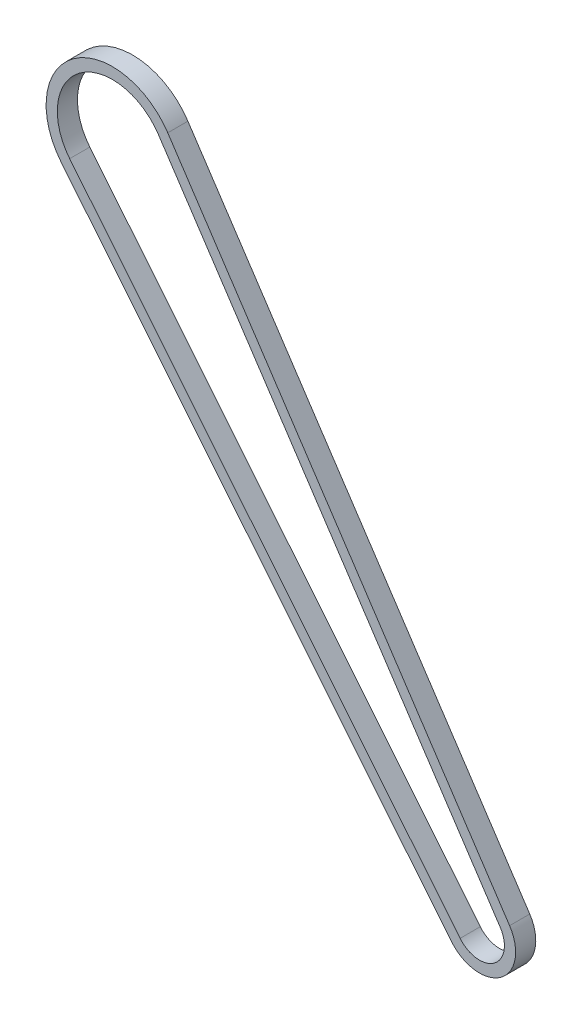
ISO-10303-21;
HEADER;
FILE_DESCRIPTION(('STEP AP214'),'2;1');
FILE_NAME('part.step','',(''),(''),'','','');
FILE_SCHEMA(('AUTOMOTIVE_DESIGN { 1 0 10303 214 1 1 1 1 }'));
ENDSEC;
DATA;
#1=APPLICATION_CONTEXT('core data for automotive mechanical design processes');
#2=APPLICATION_PROTOCOL_DEFINITION('international standard','automotive_design',2000,#1);
#3=PRODUCT_CONTEXT('',#1,'mechanical');
#4=PRODUCT('Part','Part','',(#3));
#5=PRODUCT_RELATED_PRODUCT_CATEGORY('part','',(#4));
#6=PRODUCT_DEFINITION_FORMATION('','',#4);
#7=PRODUCT_DEFINITION_CONTEXT('part definition',#1,'design');
#8=PRODUCT_DEFINITION('design','',#6,#7);
#9=PRODUCT_DEFINITION_SHAPE('','',#8);
#10=(LENGTH_UNIT() NAMED_UNIT(*) SI_UNIT(.MILLI.,.METRE.));
#11=(NAMED_UNIT(*) PLANE_ANGLE_UNIT() SI_UNIT($,.RADIAN.));
#12=(NAMED_UNIT(*) SI_UNIT($,.STERADIAN.) SOLID_ANGLE_UNIT());
#13=UNCERTAINTY_MEASURE_WITH_UNIT(LENGTH_MEASURE(1.E-05),#10,'distance_accuracy_value','');
#14=(GEOMETRIC_REPRESENTATION_CONTEXT(3) GLOBAL_UNCERTAINTY_ASSIGNED_CONTEXT((#13)) GLOBAL_UNIT_ASSIGNED_CONTEXT((#10,
#11,#12)) REPRESENTATION_CONTEXT('',''));
#15=CARTESIAN_POINT('',(0.,0.,0.));
#16=DIRECTION('',(0.,0.,1.));
#17=DIRECTION('',(1.,0.,0.));
#18=AXIS2_PLACEMENT_3D('',#15,#16,#17);
#19=CARTESIAN_POINT('',(0.,0.,-9.));
#20=DIRECTION('',(0.,0.,1.));
#21=DIRECTION('',(1.,0.,0.));
#22=AXIS2_PLACEMENT_3D('',#19,#20,#21);
#23=CYLINDRICAL_SURFACE('',#22,29.625);
#24=CARTESIAN_POINT('',(0.,0.,0.));
#25=DIRECTION('',(0.,0.,-1.));
#26=DIRECTION('',(-1.,0.,0.));
#27=AXIS2_PLACEMENT_3D('',#24,#25,#26);
#28=CIRCLE('',#27,29.625);
#29=CARTESIAN_POINT('',(24.6929425962303,16.3676269183799,0.));
#30=VERTEX_POINT('',#29);
#31=CARTESIAN_POINT('',(-22.981780910845,-18.694340618645,0.));
#32=VERTEX_POINT('',#31);
#33=EDGE_CURVE('E157',#30,#32,#28,.F.);
#34=ORIENTED_EDGE('',*,*,#33,.F.);
#35=DIRECTION('',(0.,0.,1.));
#36=VECTOR('',#35,1.);
#37=CARTESIAN_POINT('',(24.6929425962303,16.3676269183799,-9.));
#38=LINE('',#37,#36);
#39=CARTESIAN_POINT('',(24.6929425962303,16.3676269183799,-9.));
#40=VERTEX_POINT('',#39);
#41=EDGE_CURVE('E12',#40,#30,#38,.T.);
#42=ORIENTED_EDGE('',*,*,#41,.F.);
#43=CARTESIAN_POINT('',(0.,0.,-9.));
#44=DIRECTION('',(0.,0.,-1.));
#45=DIRECTION('',(-1.,0.,0.));
#46=AXIS2_PLACEMENT_3D('',#43,#44,#45);
#47=CIRCLE('',#46,29.625);
#48=CARTESIAN_POINT('',(-22.981780910845,-18.694340618645,-9.00000000000001));
#49=VERTEX_POINT('',#48);
#50=EDGE_CURVE('E161',#40,#49,#47,.F.);
#51=ORIENTED_EDGE('',*,*,#50,.T.);
#52=DIRECTION('',(0.,0.,1.));
#53=VECTOR('',#52,1.);
#54=CARTESIAN_POINT('',(-22.981780910845,-18.694340618645,-9.00000000000001));
#55=LINE('',#54,#53);
#56=EDGE_CURVE('E62',#49,#32,#55,.T.);
#57=ORIENTED_EDGE('',*,*,#56,.T.);
#58=EDGE_LOOP('',(#34,#42,#51,#57));
#59=FACE_BOUND('',#58,.T.);
#60=ADVANCED_FACE('F59',(#59),#23,.T.);
#61=CARTESIAN_POINT('',(24.6929425962303,16.3676269183799,-9.));
#62=DIRECTION('',(0.833517049661783,0.552493735641515,0.));
#63=DIRECTION('',(-0.552493735641515,0.833517049661784,0.));
#64=AXIS2_PLACEMENT_3D('',#61,#62,#63);
#65=PLANE('',#64);
#66=DIRECTION('',(-0.552493735641515,0.833517049661784,0.));
#67=VECTOR('',#66,1.);
#68=CARTESIAN_POINT('',(24.6929425962303,16.3676269183799,0.));
#69=LINE('',#68,#67);
#70=CARTESIAN_POINT('',(177.35234041152,-213.941248389316,0.));
#71=VERTEX_POINT('',#70);
#72=EDGE_CURVE('E165',#71,#30,#69,.T.);
#73=ORIENTED_EDGE('',*,*,#72,.F.);
#74=DIRECTION('',(0.,0.,1.));
#75=VECTOR('',#74,1.);
#76=CARTESIAN_POINT('',(177.35234041152,-213.941248389316,-9.));
#77=LINE('',#76,#75);
#78=CARTESIAN_POINT('',(177.35234041152,-213.941248389316,-9.));
#79=VERTEX_POINT('',#78);
#80=EDGE_CURVE('E67',#79,#71,#77,.T.);
#81=ORIENTED_EDGE('',*,*,#80,.F.);
#82=DIRECTION('',(-0.552493735641515,0.833517049661784,0.));
#83=VECTOR('',#82,1.);
#84=CARTESIAN_POINT('',(24.6929425962303,16.3676269183799,-9.));
#85=LINE('',#84,#83);
#86=EDGE_CURVE('E171',#79,#40,#85,.T.);
#87=ORIENTED_EDGE('',*,*,#86,.T.);
#88=ORIENTED_EDGE('',*,*,#41,.T.);
#89=EDGE_LOOP('',(#73,#81,#87,#88));
#90=FACE_BOUND('',#89,.T.);
#91=ADVANCED_FACE('F197',(#90),#65,.T.);
#92=CARTESIAN_POINT('',(163.899375229978,-222.85849728257,-9.));
#93=DIRECTION('',(0.,0.,1.));
#94=DIRECTION('',(1.,0.,0.));
#95=AXIS2_PLACEMENT_3D('',#92,#93,#94);
#96=CYLINDRICAL_SURFACE('',#95,16.14);
#97=CARTESIAN_POINT('',(163.899375229978,-222.85849728257,0.));
#98=DIRECTION('',(0.,0.,-1.));
#99=DIRECTION('',(-1.,0.,0.));
#100=AXIS2_PLACEMENT_3D('',#97,#98,#99);
#101=CIRCLE('',#100,16.14);
#102=CARTESIAN_POINT('',(151.378668262855,-233.043363361386,0.));
#103=VERTEX_POINT('',#102);
#104=EDGE_CURVE('E179',#103,#71,#101,.F.);
#105=ORIENTED_EDGE('',*,*,#104,.F.);
#106=DIRECTION('',(0.,0.,1.));
#107=VECTOR('',#106,1.);
#108=CARTESIAN_POINT('',(151.378668262855,-233.043363361386,-9.00000000000001));
#109=LINE('',#108,#107);
#110=CARTESIAN_POINT('',(151.378668262855,-233.043363361386,-9.00000000000001));
#111=VERTEX_POINT('',#110);
#112=EDGE_CURVE('E184',#111,#103,#109,.T.);
#113=ORIENTED_EDGE('',*,*,#112,.F.);
#114=CARTESIAN_POINT('',(163.899375229978,-222.85849728257,-9.));
#115=DIRECTION('',(0.,0.,-1.));
#116=DIRECTION('',(-1.,0.,0.));
#117=AXIS2_PLACEMENT_3D('',#114,#115,#116);
#118=CIRCLE('',#117,16.14);
#119=EDGE_CURVE('E168',#111,#79,#118,.F.);
#120=ORIENTED_EDGE('',*,*,#119,.T.);
#121=ORIENTED_EDGE('',*,*,#80,.T.);
#122=EDGE_LOOP('',(#105,#113,#120,#121));
#123=FACE_BOUND('',#122,.T.);
#124=ADVANCED_FACE('F201',(#123),#96,.T.);
#125=CARTESIAN_POINT('',(-22.981780910845,-18.6943406186451,-9.));
#126=DIRECTION('',(-0.775756317665653,-0.631032594722195,0.));
#127=DIRECTION('',(0.631032594722195,-0.775756317665653,0.));
#128=AXIS2_PLACEMENT_3D('',#125,#126,#127);
#129=PLANE('',#128);
#130=DIRECTION('',(0.631032594722195,-0.775756317665653,0.));
#131=VECTOR('',#130,1.);
#132=CARTESIAN_POINT('',(-22.981780910845,-18.6943406186451,0.));
#133=LINE('',#132,#131);
#134=EDGE_CURVE('E176',#32,#103,#133,.T.);
#135=ORIENTED_EDGE('',*,*,#134,.F.);
#136=ORIENTED_EDGE('',*,*,#56,.F.);
#137=DIRECTION('',(0.631032594722195,-0.775756317665653,0.));
#138=VECTOR('',#137,1.);
#139=CARTESIAN_POINT('',(-22.981780910845,-18.6943406186451,-9.));
#140=LINE('',#139,#138);
#141=EDGE_CURVE('E164',#49,#111,#140,.T.);
#142=ORIENTED_EDGE('',*,*,#141,.T.);
#143=ORIENTED_EDGE('',*,*,#112,.T.);
#144=EDGE_LOOP('',(#135,#136,#142,#143));
#145=FACE_BOUND('',#144,.T.);
#146=ADVANCED_FACE('F192',(#145),#129,.T.);
#147=CARTESIAN_POINT('',(0.,0.,-9.));
#148=DIRECTION('',(0.,0.,-1.));
#149=DIRECTION('',(-1.,0.,0.));
#150=AXIS2_PLACEMENT_3D('',#147,#148,#149);
#151=PLANE('',#150);
#152=CARTESIAN_POINT('',(0.,0.,-9.));
#153=DIRECTION('',(0.,0.,1.));
#154=DIRECTION('',(-1.,0.,0.));
#155=AXIS2_PLACEMENT_3D('',#152,#153,#154);
#156=CIRCLE('',#155,24.625);
#157=CARTESIAN_POINT('',(20.5253573479214,13.6051582401723,-9.));
#158=VERTEX_POINT('',#157);
#159=CARTESIAN_POINT('',(-19.1029993225167,-15.5391776450341,-9.));
#160=VERTEX_POINT('',#159);
#161=EDGE_CURVE('E126',#158,#160,#156,.T.);
#162=ORIENTED_EDGE('',*,*,#161,.T.);
#163=DIRECTION('',(0.631032594722195,-0.775756317665653,0.));
#164=VECTOR('',#163,1.);
#165=CARTESIAN_POINT('',(155.257449851183,-229.888200387775,-9.));
#166=LINE('',#165,#164);
#167=CARTESIAN_POINT('',(155.257449851183,-229.888200387775,-9.));
#168=VERTEX_POINT('',#167);
#169=EDGE_CURVE('E135',#160,#168,#166,.T.);
#170=ORIENTED_EDGE('',*,*,#169,.T.);
#171=CARTESIAN_POINT('',(163.899375229978,-222.85849728257,-9.));
#172=DIRECTION('',(0.,0.,1.));
#173=DIRECTION('',(-1.,0.,0.));
#174=AXIS2_PLACEMENT_3D('',#171,#172,#173);
#175=CIRCLE('',#174,11.14);
#176=CARTESIAN_POINT('',(173.184755163211,-216.703717067523,-9.));
#177=VERTEX_POINT('',#176);
#178=EDGE_CURVE('E75',#168,#177,#175,.T.);
#179=ORIENTED_EDGE('',*,*,#178,.T.);
#180=DIRECTION('',(-0.552493735641515,0.833517049661784,0.));
#181=VECTOR('',#180,1.);
#182=CARTESIAN_POINT('',(20.5253573479214,13.6051582401723,-9.));
#183=LINE('',#182,#181);
#184=EDGE_CURVE('E132',#177,#158,#183,.T.);
#185=ORIENTED_EDGE('',*,*,#184,.T.);
#186=EDGE_LOOP('',(#162,#170,#179,#185));
#187=FACE_BOUND('',#186,.T.);
#188=ORIENTED_EDGE('',*,*,#50,.F.);
#189=ORIENTED_EDGE('',*,*,#86,.F.);
#190=ORIENTED_EDGE('',*,*,#119,.F.);
#191=ORIENTED_EDGE('',*,*,#141,.F.);
#192=EDGE_LOOP('',(#188,#189,#190,#191));
#193=FACE_BOUND('',#192,.T.);
#194=ADVANCED_FACE('F139',(#187,#193),#151,.T.);
#195=CARTESIAN_POINT('',(0.,0.,0.));
#196=DIRECTION('',(0.,0.,-1.));
#197=DIRECTION('',(-1.,0.,0.));
#198=AXIS2_PLACEMENT_3D('',#195,#196,#197);
#199=PLANE('',#198);
#200=DIRECTION('',(0.631032594722195,-0.775756317665653,0.));
#201=VECTOR('',#200,1.);
#202=CARTESIAN_POINT('',(155.257449851183,-229.888200387775,0.));
#203=LINE('',#202,#201);
#204=CARTESIAN_POINT('',(-19.1029993225167,-15.5391776450341,0.));
#205=VERTEX_POINT('',#204);
#206=CARTESIAN_POINT('',(155.257449851183,-229.888200387775,0.));
#207=VERTEX_POINT('',#206);
#208=EDGE_CURVE('E151',#205,#207,#203,.T.);
#209=ORIENTED_EDGE('',*,*,#208,.F.);
#210=CARTESIAN_POINT('',(0.,0.,0.));
#211=DIRECTION('',(0.,0.,1.));
#212=DIRECTION('',(-1.,0.,0.));
#213=AXIS2_PLACEMENT_3D('',#210,#211,#212);
#214=CIRCLE('',#213,24.625);
#215=CARTESIAN_POINT('',(20.5253573479214,13.6051582401723,0.));
#216=VERTEX_POINT('',#215);
#217=EDGE_CURVE('E83',#216,#205,#214,.T.);
#218=ORIENTED_EDGE('',*,*,#217,.F.);
#219=DIRECTION('',(-0.552493735641515,0.833517049661784,0.));
#220=VECTOR('',#219,1.);
#221=CARTESIAN_POINT('',(20.5253573479214,13.6051582401723,0.));
#222=LINE('',#221,#220);
#223=CARTESIAN_POINT('',(173.184755163211,-216.703717067523,0.));
#224=VERTEX_POINT('',#223);
#225=EDGE_CURVE('E142',#224,#216,#222,.T.);
#226=ORIENTED_EDGE('',*,*,#225,.F.);
#227=CARTESIAN_POINT('',(163.899375229978,-222.85849728257,0.));
#228=DIRECTION('',(0.,0.,1.));
#229=DIRECTION('',(-1.,0.,0.));
#230=AXIS2_PLACEMENT_3D('',#227,#228,#229);
#231=CIRCLE('',#230,11.14);
#232=EDGE_CURVE('E145',#207,#224,#231,.T.);
#233=ORIENTED_EDGE('',*,*,#232,.F.);
#234=EDGE_LOOP('',(#209,#218,#226,#233));
#235=FACE_BOUND('',#234,.T.);
#236=ORIENTED_EDGE('',*,*,#33,.T.);
#237=ORIENTED_EDGE('',*,*,#134,.T.);
#238=ORIENTED_EDGE('',*,*,#104,.T.);
#239=ORIENTED_EDGE('',*,*,#72,.T.);
#240=EDGE_LOOP('',(#236,#237,#238,#239));
#241=FACE_BOUND('',#240,.T.);
#242=ADVANCED_FACE('F194',(#235,#241),#199,.F.);
#243=CARTESIAN_POINT('',(0.,0.,-9.));
#244=DIRECTION('',(0.,0.,1.));
#245=DIRECTION('',(1.,0.,0.));
#246=AXIS2_PLACEMENT_3D('',#243,#244,#245);
#247=CYLINDRICAL_SURFACE('',#246,24.625);
#248=ORIENTED_EDGE('',*,*,#217,.T.);
#249=DIRECTION('',(0.,0.,1.));
#250=VECTOR('',#249,1.);
#251=CARTESIAN_POINT('',(-19.1029993225167,-15.5391776450341,-9.));
#252=LINE('',#251,#250);
#253=EDGE_CURVE('E122',#160,#205,#252,.T.);
#254=ORIENTED_EDGE('',*,*,#253,.F.);
#255=ORIENTED_EDGE('',*,*,#161,.F.);
#256=DIRECTION('',(0.,0.,1.));
#257=VECTOR('',#256,1.);
#258=CARTESIAN_POINT('',(20.5253573479214,13.6051582401723,-9.));
#259=LINE('',#258,#257);
#260=EDGE_CURVE('E155',#158,#216,#259,.T.);
#261=ORIENTED_EDGE('',*,*,#260,.T.);
#262=EDGE_LOOP('',(#248,#254,#255,#261));
#263=FACE_BOUND('',#262,.T.);
#264=ADVANCED_FACE('F124',(#263),#247,.F.);
#265=CARTESIAN_POINT('',(20.5253573479214,13.6051582401723,-9.));
#266=DIRECTION('',(0.833517049661783,0.552493735641515,0.));
#267=DIRECTION('',(-0.552493735641515,0.833517049661784,0.));
#268=AXIS2_PLACEMENT_3D('',#265,#266,#267);
#269=PLANE('',#268);
#270=ORIENTED_EDGE('',*,*,#225,.T.);
#271=ORIENTED_EDGE('',*,*,#260,.F.);
#272=ORIENTED_EDGE('',*,*,#184,.F.);
#273=DIRECTION('',(0.,0.,1.));
#274=VECTOR('',#273,1.);
#275=CARTESIAN_POINT('',(173.184755163211,-216.703717067523,-9.));
#276=LINE('',#275,#274);
#277=EDGE_CURVE('E158',#177,#224,#276,.T.);
#278=ORIENTED_EDGE('',*,*,#277,.T.);
#279=EDGE_LOOP('',(#270,#271,#272,#278));
#280=FACE_BOUND('',#279,.T.);
#281=ADVANCED_FACE('F252',(#280),#269,.F.);
#282=CARTESIAN_POINT('',(163.899375229978,-222.85849728257,-9.));
#283=DIRECTION('',(0.,0.,1.));
#284=DIRECTION('',(1.,0.,0.));
#285=AXIS2_PLACEMENT_3D('',#282,#283,#284);
#286=CYLINDRICAL_SURFACE('',#285,11.14);
#287=ORIENTED_EDGE('',*,*,#232,.T.);
#288=ORIENTED_EDGE('',*,*,#277,.F.);
#289=ORIENTED_EDGE('',*,*,#178,.F.);
#290=DIRECTION('',(0.,0.,1.));
#291=VECTOR('',#290,1.);
#292=CARTESIAN_POINT('',(155.257449851183,-229.888200387775,-9.));
#293=LINE('',#292,#291);
#294=EDGE_CURVE('E131',#168,#207,#293,.T.);
#295=ORIENTED_EDGE('',*,*,#294,.T.);
#296=EDGE_LOOP('',(#287,#288,#289,#295));
#297=FACE_BOUND('',#296,.T.);
#298=ADVANCED_FACE('F261',(#297),#286,.F.);
#299=CARTESIAN_POINT('',(155.257449851183,-229.888200387775,-9.));
#300=DIRECTION('',(-0.775756317665653,-0.631032594722195,0.));
#301=DIRECTION('',(0.631032594722195,-0.775756317665653,0.));
#302=AXIS2_PLACEMENT_3D('',#299,#300,#301);
#303=PLANE('',#302);
#304=ORIENTED_EDGE('',*,*,#208,.T.);
#305=ORIENTED_EDGE('',*,*,#294,.F.);
#306=ORIENTED_EDGE('',*,*,#169,.F.);
#307=ORIENTED_EDGE('',*,*,#253,.T.);
#308=EDGE_LOOP('',(#304,#305,#306,#307));
#309=FACE_BOUND('',#308,.T.);
#310=ADVANCED_FACE('F136',(#309),#303,.F.);
#311=CLOSED_SHELL('',(#60,#91,#124,#146,#194,#242,#264,#281,#298,#310));
#312=MANIFOLD_SOLID_BREP('B2',#311);
#313=ADVANCED_BREP_SHAPE_REPRESENTATION('',(#18,#312),#14);
#314=SHAPE_DEFINITION_REPRESENTATION(#9,#313);
ENDSEC;
END-ISO-10303-21;
